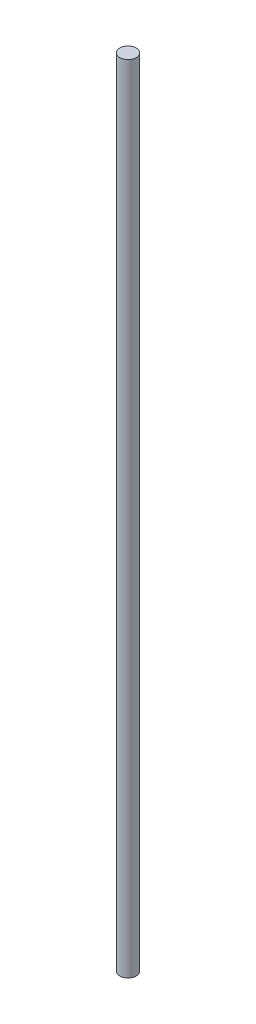
ISO-10303-21;
HEADER;
FILE_DESCRIPTION(('STEP AP214'),'2;1');
FILE_NAME('part.step','',(''),(''),'','','');
FILE_SCHEMA(('AUTOMOTIVE_DESIGN { 1 0 10303 214 1 1 1 1 }'));
ENDSEC;
DATA;
#1=APPLICATION_CONTEXT('core data for automotive mechanical design processes');
#2=APPLICATION_PROTOCOL_DEFINITION('international standard','automotive_design',2000,#1);
#3=PRODUCT_CONTEXT('',#1,'mechanical');
#4=PRODUCT('Part','Part','',(#3));
#5=PRODUCT_RELATED_PRODUCT_CATEGORY('part','',(#4));
#6=PRODUCT_DEFINITION_FORMATION('','',#4);
#7=PRODUCT_DEFINITION_CONTEXT('part definition',#1,'design');
#8=PRODUCT_DEFINITION('design','',#6,#7);
#9=PRODUCT_DEFINITION_SHAPE('','',#8);
#10=(LENGTH_UNIT() NAMED_UNIT(*) SI_UNIT(.MILLI.,.METRE.));
#11=(NAMED_UNIT(*) PLANE_ANGLE_UNIT() SI_UNIT($,.RADIAN.));
#12=(NAMED_UNIT(*) SI_UNIT($,.STERADIAN.) SOLID_ANGLE_UNIT());
#13=UNCERTAINTY_MEASURE_WITH_UNIT(LENGTH_MEASURE(1.E-05),#10,'distance_accuracy_value','');
#14=(GEOMETRIC_REPRESENTATION_CONTEXT(3) GLOBAL_UNCERTAINTY_ASSIGNED_CONTEXT((#13)) GLOBAL_UNIT_ASSIGNED_CONTEXT((#10,
#11,#12)) REPRESENTATION_CONTEXT('',''));
#15=CARTESIAN_POINT('',(0.,0.,0.));
#16=DIRECTION('',(0.,0.,1.));
#17=DIRECTION('',(1.,0.,0.));
#18=AXIS2_PLACEMENT_3D('',#15,#16,#17);
#19=CARTESIAN_POINT('',(0.,455.,0.));
#20=DIRECTION('',(0.,-1.,0.));
#21=DIRECTION('',(0.,0.,-1.));
#22=AXIS2_PLACEMENT_3D('',#19,#20,#21);
#23=CYLINDRICAL_SURFACE('',#22,4.75);
#24=CARTESIAN_POINT('',(0.,455.,0.));
#25=DIRECTION('',(0.,1.,0.));
#26=DIRECTION('',(0.,0.,1.));
#27=AXIS2_PLACEMENT_3D('',#24,#25,#26);
#28=CIRCLE('',#27,4.75);
#29=CARTESIAN_POINT('',(0.,455.,4.75));
#30=VERTEX_POINT('',#29);
#31=EDGE_CURVE('E10',#30,#30,#28,.T.);
#32=ORIENTED_EDGE('',*,*,#31,.F.);
#33=EDGE_LOOP('',(#32));
#34=FACE_BOUND('',#33,.T.);
#35=CARTESIAN_POINT('',(0.,0.,0.));
#36=DIRECTION('',(0.,1.,0.));
#37=DIRECTION('',(0.,0.,1.));
#38=AXIS2_PLACEMENT_3D('',#35,#36,#37);
#39=CIRCLE('',#38,4.75);
#40=CARTESIAN_POINT('',(0.,0.,4.75));
#41=VERTEX_POINT('',#40);
#42=EDGE_CURVE('E40',#41,#41,#39,.T.);
#43=ORIENTED_EDGE('',*,*,#42,.T.);
#44=EDGE_LOOP('',(#43));
#45=FACE_BOUND('',#44,.T.);
#46=ADVANCED_FACE('F37',(#34,#45),#23,.T.);
#47=CARTESIAN_POINT('',(0.,455.,0.));
#48=DIRECTION('',(0.,1.,0.));
#49=DIRECTION('',(0.,0.,1.));
#50=AXIS2_PLACEMENT_3D('',#47,#48,#49);
#51=PLANE('',#50);
#52=ORIENTED_EDGE('',*,*,#31,.T.);
#53=EDGE_LOOP('',(#52));
#54=FACE_BOUND('',#53,.T.);
#55=ADVANCED_FACE('F54',(#54),#51,.T.);
#56=CARTESIAN_POINT('',(0.,0.,0.));
#57=DIRECTION('',(0.,1.,0.));
#58=DIRECTION('',(0.,0.,1.));
#59=AXIS2_PLACEMENT_3D('',#56,#57,#58);
#60=PLANE('',#59);
#61=ORIENTED_EDGE('',*,*,#42,.F.);
#62=EDGE_LOOP('',(#61));
#63=FACE_BOUND('',#62,.T.);
#64=ADVANCED_FACE('F52',(#63),#60,.F.);
#65=CLOSED_SHELL('',(#46,#55,#64));
#66=MANIFOLD_SOLID_BREP('B2',#65);
#67=ADVANCED_BREP_SHAPE_REPRESENTATION('',(#18,#66),#14);
#68=SHAPE_DEFINITION_REPRESENTATION(#9,#67);
ENDSEC;
END-ISO-10303-21;
